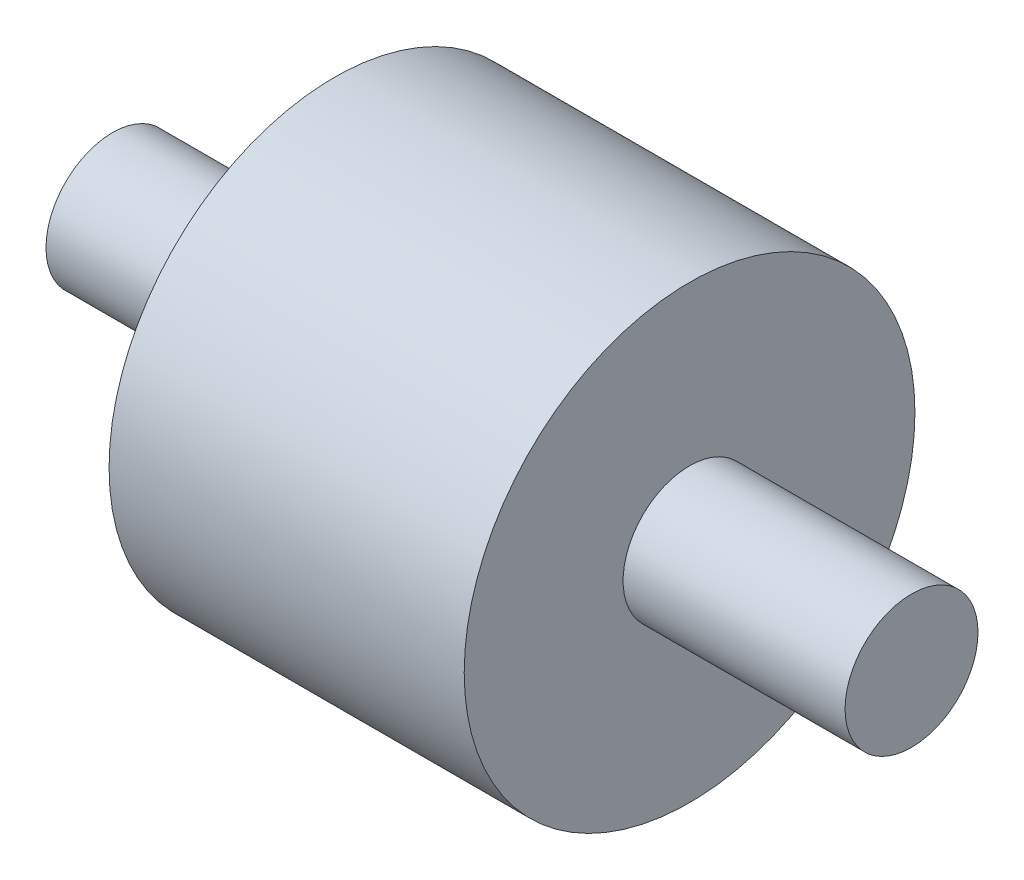
ISO-10303-21;
HEADER;
FILE_DESCRIPTION(('STEP AP214'),'2;1');
FILE_NAME('part.step','',(''),(''),'','','');
FILE_SCHEMA(('AUTOMOTIVE_DESIGN { 1 0 10303 214 1 1 1 1 }'));
ENDSEC;
DATA;
#1=APPLICATION_CONTEXT('core data for automotive mechanical design processes');
#2=APPLICATION_PROTOCOL_DEFINITION('international standard','automotive_design',2000,#1);
#3=PRODUCT_CONTEXT('',#1,'mechanical');
#4=PRODUCT('Part','Part','',(#3));
#5=PRODUCT_RELATED_PRODUCT_CATEGORY('part','',(#4));
#6=PRODUCT_DEFINITION_FORMATION('','',#4);
#7=PRODUCT_DEFINITION_CONTEXT('part definition',#1,'design');
#8=PRODUCT_DEFINITION('design','',#6,#7);
#9=PRODUCT_DEFINITION_SHAPE('','',#8);
#10=(LENGTH_UNIT() NAMED_UNIT(*) SI_UNIT(.MILLI.,.METRE.));
#11=(NAMED_UNIT(*) PLANE_ANGLE_UNIT() SI_UNIT($,.RADIAN.));
#12=(NAMED_UNIT(*) SI_UNIT($,.STERADIAN.) SOLID_ANGLE_UNIT());
#13=UNCERTAINTY_MEASURE_WITH_UNIT(LENGTH_MEASURE(1.E-05),#10,'distance_accuracy_value','');
#14=(GEOMETRIC_REPRESENTATION_CONTEXT(3) GLOBAL_UNCERTAINTY_ASSIGNED_CONTEXT((#13)) GLOBAL_UNIT_ASSIGNED_CONTEXT((#10,
#11,#12)) REPRESENTATION_CONTEXT('',''));
#15=CARTESIAN_POINT('',(0.,0.,0.));
#16=DIRECTION('',(0.,0.,1.));
#17=DIRECTION('',(1.,0.,0.));
#18=AXIS2_PLACEMENT_3D('',#15,#16,#17);
#19=CARTESIAN_POINT('',(40.,0.,0.));
#20=DIRECTION('',(-1.,0.,0.));
#21=DIRECTION('',(0.,0.,1.));
#22=AXIS2_PLACEMENT_3D('',#19,#20,#21);
#23=CYLINDRICAL_SURFACE('',#22,25.3837);
#24=CARTESIAN_POINT('',(40.,0.,0.));
#25=DIRECTION('',(1.,0.,0.));
#26=DIRECTION('',(0.,0.,-1.));
#27=AXIS2_PLACEMENT_3D('',#24,#25,#26);
#28=CIRCLE('',#27,25.3837);
#29=CARTESIAN_POINT('',(40.,0.,-25.3837));
#30=VERTEX_POINT('',#29);
#31=EDGE_CURVE('E44',#30,#30,#28,.T.);
#32=ORIENTED_EDGE('',*,*,#31,.F.);
#33=EDGE_LOOP('',(#32));
#34=FACE_BOUND('',#33,.T.);
#35=CARTESIAN_POINT('',(0.,0.,0.));
#36=DIRECTION('',(1.,0.,0.));
#37=DIRECTION('',(0.,0.,-1.));
#38=AXIS2_PLACEMENT_3D('',#35,#36,#37);
#39=CIRCLE('',#38,25.3837);
#40=CARTESIAN_POINT('',(0.,0.,-25.3837));
#41=VERTEX_POINT('',#40);
#42=EDGE_CURVE('E49',#41,#41,#39,.T.);
#43=ORIENTED_EDGE('',*,*,#42,.T.);
#44=EDGE_LOOP('',(#43));
#45=FACE_BOUND('',#44,.T.);
#46=ADVANCED_FACE('F37',(#34,#45),#23,.T.);
#47=CARTESIAN_POINT('',(40.,0.,0.));
#48=DIRECTION('',(1.,0.,0.));
#49=DIRECTION('',(0.,0.,-1.));
#50=AXIS2_PLACEMENT_3D('',#47,#48,#49);
#51=PLANE('',#50);
#52=CARTESIAN_POINT('',(40.,0.,0.));
#53=DIRECTION('',(1.,0.,0.));
#54=DIRECTION('',(0.,0.,-1.));
#55=AXIS2_PLACEMENT_3D('',#52,#53,#54);
#56=CIRCLE('',#55,7.4859249828621);
#57=CARTESIAN_POINT('',(40.,0.,-7.4859249828621));
#58=VERTEX_POINT('',#57);
#59=EDGE_CURVE('E55',#58,#58,#56,.F.);
#60=ORIENTED_EDGE('',*,*,#59,.T.);
#61=EDGE_LOOP('',(#60));
#62=FACE_BOUND('',#61,.T.);
#63=ORIENTED_EDGE('',*,*,#31,.T.);
#64=EDGE_LOOP('',(#63));
#65=FACE_BOUND('',#64,.T.);
#66=ADVANCED_FACE('F82',(#62,#65),#51,.T.);
#67=CARTESIAN_POINT('',(0.,0.,0.));
#68=DIRECTION('',(1.,0.,0.));
#69=DIRECTION('',(0.,0.,-1.));
#70=AXIS2_PLACEMENT_3D('',#67,#68,#69);
#71=PLANE('',#70);
#72=CARTESIAN_POINT('',(0.,0.,0.));
#73=DIRECTION('',(1.,0.,0.));
#74=DIRECTION('',(0.,0.,-1.));
#75=AXIS2_PLACEMENT_3D('',#72,#73,#74);
#76=CIRCLE('',#75,7.4859249828621);
#77=CARTESIAN_POINT('',(0.,0.,-7.4859249828621));
#78=VERTEX_POINT('',#77);
#79=EDGE_CURVE('E10',#78,#78,#76,.F.);
#80=ORIENTED_EDGE('',*,*,#79,.F.);
#81=EDGE_LOOP('',(#80));
#82=FACE_BOUND('',#81,.T.);
#83=ORIENTED_EDGE('',*,*,#42,.F.);
#84=EDGE_LOOP('',(#83));
#85=FACE_BOUND('',#84,.T.);
#86=ADVANCED_FACE('F87',(#82,#85),#71,.F.);
#87=CARTESIAN_POINT('',(-25.,0.,0.));
#88=DIRECTION('',(-1.,0.,0.));
#89=DIRECTION('',(0.,0.,1.));
#90=AXIS2_PLACEMENT_3D('',#87,#88,#89);
#91=PLANE('',#90);
#92=CARTESIAN_POINT('',(-25.,0.,0.));
#93=DIRECTION('',(-1.,0.,0.));
#94=DIRECTION('',(0.,0.,1.));
#95=AXIS2_PLACEMENT_3D('',#92,#93,#94);
#96=CIRCLE('',#95,7.4859249828621);
#97=CARTESIAN_POINT('',(-25.,0.,7.4859249828621));
#98=VERTEX_POINT('',#97);
#99=EDGE_CURVE('E60',#98,#98,#96,.T.);
#100=ORIENTED_EDGE('',*,*,#99,.T.);
#101=EDGE_LOOP('',(#100));
#102=FACE_BOUND('',#101,.T.);
#103=ADVANCED_FACE('F94',(#102),#91,.T.);
#104=CARTESIAN_POINT('',(-25.,0.,0.));
#105=DIRECTION('',(1.,0.,0.));
#106=DIRECTION('',(0.,0.,-1.));
#107=AXIS2_PLACEMENT_3D('',#104,#105,#106);
#108=CYLINDRICAL_SURFACE('',#107,7.4859249828621);
#109=ORIENTED_EDGE('',*,*,#99,.F.);
#110=EDGE_LOOP('',(#109));
#111=FACE_BOUND('',#110,.T.);
#112=ORIENTED_EDGE('',*,*,#79,.T.);
#113=EDGE_LOOP('',(#112));
#114=FACE_BOUND('',#113,.T.);
#115=ADVANCED_FACE('F77',(#111,#114),#108,.T.);
#116=ORIENTED_EDGE('',*,*,#59,.F.);
#117=EDGE_LOOP('',(#116));
#118=FACE_BOUND('',#117,.T.);
#119=CARTESIAN_POINT('',(65.,0.,0.));
#120=DIRECTION('',(-1.,0.,0.));
#121=DIRECTION('',(0.,0.,1.));
#122=AXIS2_PLACEMENT_3D('',#119,#120,#121);
#123=CIRCLE('',#122,7.4859249828621);
#124=CARTESIAN_POINT('',(65.,0.,7.4859249828621));
#125=VERTEX_POINT('',#124);
#126=EDGE_CURVE('E64',#125,#125,#123,.T.);
#127=ORIENTED_EDGE('',*,*,#126,.T.);
#128=EDGE_LOOP('',(#127));
#129=FACE_BOUND('',#128,.T.);
#130=ADVANCED_FACE('F69',(#118,#129),#108,.T.);
#131=CARTESIAN_POINT('',(65.,0.,0.));
#132=DIRECTION('',(-1.,0.,0.));
#133=DIRECTION('',(0.,0.,1.));
#134=AXIS2_PLACEMENT_3D('',#131,#132,#133);
#135=PLANE('',#134);
#136=ORIENTED_EDGE('',*,*,#126,.F.);
#137=EDGE_LOOP('',(#136));
#138=FACE_BOUND('',#137,.T.);
#139=ADVANCED_FACE('F71',(#138),#135,.F.);
#140=CLOSED_SHELL('',(#46,#66,#86,#103,#115,#130,#139));
#141=MANIFOLD_SOLID_BREP('B2',#140);
#142=ADVANCED_BREP_SHAPE_REPRESENTATION('',(#18,#141),#14);
#143=SHAPE_DEFINITION_REPRESENTATION(#9,#142);
ENDSEC;
END-ISO-10303-21;
